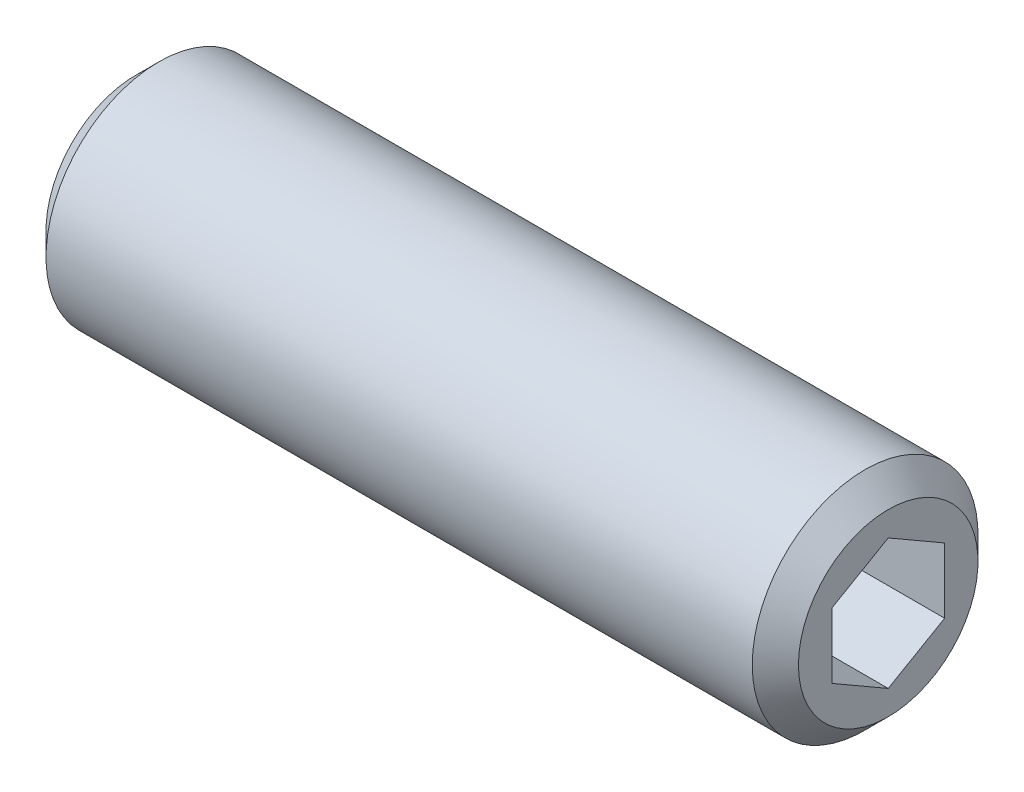
ISO-10303-21;
HEADER;
FILE_DESCRIPTION(('STEP AP214'),'2;1');
FILE_NAME('part.step','',(''),(''),'','','');
FILE_SCHEMA(('AUTOMOTIVE_DESIGN { 1 0 10303 214 1 1 1 1 }'));
ENDSEC;
DATA;
#1=APPLICATION_CONTEXT('core data for automotive mechanical design processes');
#2=APPLICATION_PROTOCOL_DEFINITION('international standard','automotive_design',2000,#1);
#3=PRODUCT_CONTEXT('',#1,'mechanical');
#4=PRODUCT('Part','Part','',(#3));
#5=PRODUCT_RELATED_PRODUCT_CATEGORY('part','',(#4));
#6=PRODUCT_DEFINITION_FORMATION('','',#4);
#7=PRODUCT_DEFINITION_CONTEXT('part definition',#1,'design');
#8=PRODUCT_DEFINITION('design','',#6,#7);
#9=PRODUCT_DEFINITION_SHAPE('','',#8);
#10=(LENGTH_UNIT() NAMED_UNIT(*) SI_UNIT(.MILLI.,.METRE.));
#11=(NAMED_UNIT(*) PLANE_ANGLE_UNIT() SI_UNIT($,.RADIAN.));
#12=(NAMED_UNIT(*) SI_UNIT($,.STERADIAN.) SOLID_ANGLE_UNIT());
#13=UNCERTAINTY_MEASURE_WITH_UNIT(LENGTH_MEASURE(1.E-05),#10,'distance_accuracy_value','');
#14=(GEOMETRIC_REPRESENTATION_CONTEXT(3) GLOBAL_UNCERTAINTY_ASSIGNED_CONTEXT((#13)) GLOBAL_UNIT_ASSIGNED_CONTEXT((#10,
#11,#12)) REPRESENTATION_CONTEXT('',''));
#15=CARTESIAN_POINT('',(0.,0.,0.));
#16=DIRECTION('',(0.,0.,1.));
#17=DIRECTION('',(1.,0.,0.));
#18=AXIS2_PLACEMENT_3D('',#15,#16,#17);
#19=CARTESIAN_POINT('',(10.,-0.433012701892202,-0.750000000000006));
#20=DIRECTION('',(0.,0.,-1.));
#21=DIRECTION('',(0.,1.,0.));
#22=AXIS2_PLACEMENT_3D('',#19,#20,#21);
#23=PLANE('',#22);
#24=DIRECTION('',(1.,0.,0.));
#25=VECTOR('',#24,1.);
#26=CARTESIAN_POINT('',(10.,-0.433012701892204,-0.750000000000003));
#27=LINE('',#26,#25);
#28=CARTESIAN_POINT('',(7.99999999998905,-0.433012701892995,-0.750000000001374));
#29=VERTEX_POINT('',#28);
#30=CARTESIAN_POINT('',(10.,-0.433012701892204,-0.750000000000004));
#31=VERTEX_POINT('',#30);
#32=EDGE_CURVE('E77',#29,#31,#27,.T.);
#33=ORIENTED_EDGE('',*,*,#32,.T.);
#34=DIRECTION('',(0.,1.,0.));
#35=VECTOR('',#34,1.);
#36=CARTESIAN_POINT('',(10.,-0.433012701892202,-0.750000000000006));
#37=LINE('',#36,#35);
#38=CARTESIAN_POINT('',(10.,0.433012701892233,-0.749999999999989));
#39=VERTEX_POINT('',#38);
#40=EDGE_CURVE('E83',#39,#31,#37,.F.);
#41=ORIENTED_EDGE('',*,*,#40,.F.);
#42=DIRECTION('',(1.,0.,0.));
#43=VECTOR('',#42,1.);
#44=CARTESIAN_POINT('',(10.,0.433012701892233,-0.749999999999989));
#45=LINE('',#44,#43);
#46=CARTESIAN_POINT('',(7.99999999998859,0.433012701893813,-0.749999999999989));
#47=VERTEX_POINT('',#46);
#48=EDGE_CURVE('E80',#39,#47,#45,.F.);
#49=ORIENTED_EDGE('',*,*,#48,.T.);
#50=CARTESIAN_POINT('',(7.99999999998905,-0.433012701895366,-0.750000000000006));
#51=CARTESIAN_POINT('',(7.98901082827057,-0.394956130487069,-0.750000000000005));
#52=CARTESIAN_POINT('',(7.97901675265749,-0.356571055071816,-0.750000000000004));
#53=CARTESIAN_POINT('',(7.9615723944878,-0.279136292184678,-0.750000000000003));
#54=CARTESIAN_POINT('',(7.95412828241216,-0.240085229294405,-0.750000000000002));
#55=CARTESIAN_POINT('',(7.94254098479773,-0.162467043916568,-0.750000000000001));
#56=CARTESIAN_POINT('',(7.93832067039372,-0.1239118606329,-0.75));
#57=CARTESIAN_POINT('',(7.93328343798614,-0.0466201738001358,-0.749999999999998));
#58=CARTESIAN_POINT('',(7.93246234771774,-0.00788395099258692,-0.749999999999997));
#59=CARTESIAN_POINT('',(7.93417485881037,0.0644905257924131,-0.749999999999996));
#60=CARTESIAN_POINT('',(7.9362879819497,0.0981396401509972,-0.749999999999995));
#61=CARTESIAN_POINT('',(7.94298398775631,0.165218655866387,-0.749999999999994));
#62=CARTESIAN_POINT('',(7.94756915552737,0.19864832538796,-0.749999999999993));
#63=CARTESIAN_POINT('',(7.95903118749256,0.265865530203378,-0.749999999999992));
#64=CARTESIAN_POINT('',(7.96595661582194,0.299644562544435,-0.749999999999991));
#65=CARTESIAN_POINT('',(7.98167441030362,0.366698958674413,-0.74999999999999));
#66=CARTESIAN_POINT('',(7.99046308577034,0.399975180844981,-0.749999999999989));
#67=CARTESIAN_POINT('',(7.99999999998905,0.433012701895392,-0.749999999999989));
#68=B_SPLINE_CURVE_WITH_KNOTS('',3,(#50,#51,#52,#53,#54,#55,#56,#57,#58,#59,#60,#61,#62,#63,#64,
#65,#66,#67),.UNSPECIFIED.,.F.,.F.,(4,2,2,2,2,2,2,2,4),(0.,0.118881004365211,0.238047681452815,
0.354265352374621,0.470340333403598,0.57139041855578,0.672534072743626,0.775920608505794,
0.87910424014248),.UNSPECIFIED.);
#69=EDGE_CURVE('E21',#29,#47,#68,.T.);
#70=ORIENTED_EDGE('',*,*,#69,.F.);
#71=EDGE_LOOP('',(#33,#41,#49,#70));
#72=FACE_BOUND('',#71,.T.);
#73=ADVANCED_FACE('F17',(#72),#23,.F.);
#74=CARTESIAN_POINT('',(10.,-0.866025403784435,0.));
#75=DIRECTION('',(0.,-0.866025403784429,-0.500000000000017));
#76=DIRECTION('',(0.,0.500000000000017,-0.866025403784429));
#77=AXIS2_PLACEMENT_3D('',#74,#75,#76);
#78=PLANE('',#77);
#79=DIRECTION('',(1.,0.,0.));
#80=VECTOR('',#79,1.);
#81=CARTESIAN_POINT('',(10.,-0.866025403784434,0.));
#82=LINE('',#81,#80);
#83=CARTESIAN_POINT('',(7.99999999998802,-0.866025403784234,-3.63860124789172E-13));
#84=VERTEX_POINT('',#83);
#85=CARTESIAN_POINT('',(10.,-0.866025403784434,0.));
#86=VERTEX_POINT('',#85);
#87=EDGE_CURVE('E154',#84,#86,#82,.T.);
#88=ORIENTED_EDGE('',*,*,#87,.T.);
#89=DIRECTION('',(0.,0.500000000000017,-0.866025403784429));
#90=VECTOR('',#89,1.);
#91=CARTESIAN_POINT('',(10.,-0.866025403784435,0.));
#92=LINE('',#91,#90);
#93=EDGE_CURVE('E93',#31,#86,#92,.F.);
#94=ORIENTED_EDGE('',*,*,#93,.F.);
#95=ORIENTED_EDGE('',*,*,#32,.F.);
#96=CARTESIAN_POINT('',(7.99999999998791,-0.866025403784034,-7.12328628866254E-13));
#97=CARTESIAN_POINT('',(7.98901082826951,-0.846997118079918,-0.0329579576211769));
#98=CARTESIAN_POINT('',(7.97901675265654,-0.827804580372323,-0.06620040805691));
#99=CARTESIAN_POINT('',(7.96157239448706,-0.789087198928822,-0.133260879853075));
#100=CARTESIAN_POINT('',(7.95412828241152,-0.769561667483722,-0.167080092360772));
#101=CARTESIAN_POINT('',(7.94254098479731,-0.730752574794874,-0.234299412693503));
#102=CARTESIAN_POINT('',(7.9383206703934,-0.711474983153075,-0.267689180864662));
#103=CARTESIAN_POINT('',(7.93328343798603,-0.672829139736769,-0.334625745163053));
#104=CARTESIAN_POINT('',(7.93246234771773,-0.653461028333034,-0.368172298160975));
#105=CARTESIAN_POINT('',(7.93417485881052,-0.617273789940701,-0.430850433642099));
#106=CARTESIAN_POINT('',(7.9362879819499,-0.600449232761536,-0.45999142149126));
#107=CARTESIAN_POINT('',(7.94298398775657,-0.566909724904095,-0.5180835531612));
#108=CARTESIAN_POINT('',(7.94756915552764,-0.550194890143436,-0.547034496206779));
#109=CARTESIAN_POINT('',(7.95903118749282,-0.516586287735986,-0.605246303147861));
#110=CARTESIAN_POINT('',(7.96595661582217,-0.499696771565589,-0.634499803270243));
#111=CARTESIAN_POINT('',(7.98167441030376,-0.46616957350086,-0.692570613753776));
#112=CARTESIAN_POINT('',(7.99046308577041,-0.449531462415704,-0.721388667495241));
#113=CARTESIAN_POINT('',(7.99999999998905,-0.433012701890623,-0.750000000002742));
#114=B_SPLINE_CURVE_WITH_KNOTS('',3,(#96,#97,#98,#99,#100,#101,#102,#103,#104,#105,#106,#107,
#108,#109,#110,#111,#112,#113),.UNSPECIFIED.,.F.,.F.,(4,2,2,2,2,2,2,2,4),(0.,0.118881004364944,
0.238047681452273,0.35426535237383,0.470340333402559,0.571390418553991,0.672534072741082,
0.775920608502456,0.879104240138354),.UNSPECIFIED.);
#115=EDGE_CURVE('E85',#84,#29,#114,.T.);
#116=ORIENTED_EDGE('',*,*,#115,.F.);
#117=EDGE_LOOP('',(#88,#94,#95,#116));
#118=FACE_BOUND('',#117,.T.);
#119=ADVANCED_FACE('F94',(#118),#78,.F.);
#120=CARTESIAN_POINT('',(10.,0.433012701892233,-0.749999999999989));
#121=DIRECTION('',(0.,0.866025403784449,-0.499999999999983));
#122=DIRECTION('',(0.,0.499999999999983,0.866025403784449));
#123=AXIS2_PLACEMENT_3D('',#120,#121,#122);
#124=PLANE('',#123);
#125=ORIENTED_EDGE('',*,*,#48,.F.);
#126=DIRECTION('',(0.,0.499999999999983,0.866025403784449));
#127=VECTOR('',#126,1.);
#128=CARTESIAN_POINT('',(10.,0.433012701892233,-0.749999999999989));
#129=LINE('',#128,#127);
#130=CARTESIAN_POINT('',(10.,0.866025403784439,0.));
#131=VERTEX_POINT('',#130);
#132=EDGE_CURVE('E92',#131,#39,#129,.F.);
#133=ORIENTED_EDGE('',*,*,#132,.F.);
#134=DIRECTION('',(1.,0.,0.));
#135=VECTOR('',#134,1.);
#136=CARTESIAN_POINT('',(10.,0.866025403784443,0.));
#137=LINE('',#136,#135);
#138=CARTESIAN_POINT('',(8.00000000479879,0.866025412116726,1.44319543748989E-08));
#139=VERTEX_POINT('',#138);
#140=EDGE_CURVE('E214',#131,#139,#137,.F.);
#141=ORIENTED_EDGE('',*,*,#140,.T.);
#142=CARTESIAN_POINT('',(7.99999999998905,0.433012701890651,-0.750000000002728));
#143=CARTESIAN_POINT('',(7.98901082826748,0.452040987600214,-0.717042042372828));
#144=CARTESIAN_POINT('',(7.97901675265184,0.471233525313321,-0.683799591927542));
#145=CARTESIAN_POINT('',(7.96157239447831,0.50995090676871,-0.61673912011078));
#146=CARTESIAN_POINT('',(7.9541282824015,0.529476438220196,-0.582919907592021));
#147=CARTESIAN_POINT('',(7.9425409847907,0.56828553091007,-0.515700587257507));
#148=CARTESIAN_POINT('',(7.93832067038958,0.587563122546362,-0.482310819095882));
#149=CARTESIAN_POINT('',(7.93328343798548,0.626208965950657,-0.41537425481829));
#150=CARTESIAN_POINT('',(7.93246234771757,0.645577077347884,-0.381827701831638));
#151=CARTESIAN_POINT('',(7.93417485887736,0.681764317141776,-0.319149563922936));
#152=CARTESIAN_POINT('',(7.93628798230418,0.698588875725989,-0.290008573640159));
#153=CARTESIAN_POINT('',(7.94298398908129,0.732128386370181,-0.231916437143418));
#154=CARTESIAN_POINT('',(7.9475691575363,0.748843222512488,-0.202965491704752));
#155=CARTESIAN_POINT('',(7.95903119120688,0.782451827715217,-0.1447536799221));
#156=CARTESIAN_POINT('',(7.96595662057005,0.799341345297872,-0.115500177353611));
#157=CARTESIAN_POINT('',(7.98167441734414,0.832868546135736,-0.0574293620668633));
#158=CARTESIAN_POINT('',(7.99046309406811,0.849506658581953,-0.0286113059679694));
#159=CARTESIAN_POINT('',(8.00000000960943,0.866025420449008,2.88639030046372E-08));
#160=B_SPLINE_CURVE_WITH_KNOTS('',3,(#142,#143,#144,#145,#146,#147,#148,#149,#150,#151,#152,
#153,#154,#155,#156,#157,#158,#159),.UNSPECIFIED.,.F.,.F.,(4,2,2,2,2,2,2,2,4),(0.,
0.11888100439893,0.238047681524581,0.354265352412084,0.470340333403614,0.571390426997281,
0.672534089657842,0.775920634332708,0.879104274814231),.UNSPECIFIED.);
#161=EDGE_CURVE('E149',#47,#139,#160,.T.);
#162=ORIENTED_EDGE('',*,*,#161,.F.);
#163=EDGE_LOOP('',(#125,#133,#141,#162));
#164=FACE_BOUND('',#163,.T.);
#165=ADVANCED_FACE('F155',(#164),#124,.F.);
#166=CARTESIAN_POINT('',(10.,-0.433012701892234,0.749999999999986));
#167=DIRECTION('',(0.,-0.866025403784449,0.499999999999983));
#168=DIRECTION('',(0.,-0.499999999999983,-0.866025403784449));
#169=AXIS2_PLACEMENT_3D('',#166,#167,#168);
#170=PLANE('',#169);
#171=DIRECTION('',(1.,0.,0.));
#172=VECTOR('',#171,1.);
#173=CARTESIAN_POINT('',(10.,-0.433012701892234,0.749999999999986));
#174=LINE('',#173,#172);
#175=CARTESIAN_POINT('',(7.99999999229925,-0.433012740202588,0.749999962503712));
#176=VERTEX_POINT('',#175);
#177=CARTESIAN_POINT('',(10.,-0.43301270189223,0.749999999999996));
#178=VERTEX_POINT('',#177);
#179=EDGE_CURVE('E207',#176,#178,#174,.T.);
#180=ORIENTED_EDGE('',*,*,#179,.T.);
#181=DIRECTION('',(0.,-0.499999999999983,-0.866025403784449));
#182=VECTOR('',#181,1.);
#183=CARTESIAN_POINT('',(10.,-0.433012701892234,0.749999999999986));
#184=LINE('',#183,#182);
#185=EDGE_CURVE('E220',#86,#178,#184,.F.);
#186=ORIENTED_EDGE('',*,*,#185,.F.);
#187=ORIENTED_EDGE('',*,*,#87,.F.);
#188=CARTESIAN_POINT('',(7.9999999999879,-0.866025403784033,6.80000783128613E-13));
#189=CARTESIAN_POINT('',(7.98901082827753,-0.846997118093987,0.0329579575967761));
#190=CARTESIAN_POINT('',(7.97901675267123,-0.827804580400638,0.0662004080078387));
#191=CARTESIAN_POINT('',(7.96157239451172,-0.789087198987857,0.133260879750802));
#192=CARTESIAN_POINT('',(7.95412828243922,-0.769561667559259,0.167080092229918));
#193=CARTESIAN_POINT('',(7.94254098481559,-0.7307525748729,0.234299412558344));
#194=CARTESIAN_POINT('',(7.93832067040416,-0.711474983216705,0.267689180754442));
#195=CARTESIAN_POINT('',(7.93328343798776,-0.672829139768996,0.33462574510723));
#196=CARTESIAN_POINT('',(7.93246234771818,-0.653461028348249,0.36817229813462));
#197=CARTESIAN_POINT('',(7.93417485863644,-0.61727379359742,0.43085042730848));
#198=CARTESIAN_POINT('',(7.93628798102879,-0.600449240068925,0.459991408834498));
#199=CARTESIAN_POINT('',(7.94298398431362,-0.566909739452162,0.518083527963221));
#200=CARTESIAN_POINT('',(7.94756915030746,-0.550194908281368,0.547034464790975));
#201=CARTESIAN_POINT('',(7.95903117784122,-0.516586313136742,0.605246259152482));
#202=CARTESIAN_POINT('',(7.96595660348428,-0.49969680063574,0.634499752919288));
#203=CARTESIAN_POINT('',(7.98167439200907,-0.466169609776291,0.692570550922915));
#204=CARTESIAN_POINT('',(7.99046306420877,-0.449531502227503,0.721388598539212));
#205=CARTESIAN_POINT('',(7.99999997499062,-0.433012745189202,0.749999925007439));
#206=B_SPLINE_CURVE_WITH_KNOTS('',3,(#188,#189,#190,#191,#192,#193,#194,#195,#196,#197,#198,
#199,#200,#201,#202,#203,#204,#205),.UNSPECIFIED.,.F.,.F.,(4,2,2,2,2,2,2,2,4),(0.,
0.118881004277328,0.238047681265788,0.354265352276481,0.470340333402514,0.571390396618868,
0.67253402878973,0.775920541391586,0.879104150044302),.UNSPECIFIED.);
#207=EDGE_CURVE('E88',#84,#176,#206,.T.);
#208=ORIENTED_EDGE('',*,*,#207,.T.);
#209=EDGE_LOOP('',(#180,#186,#187,#208));
#210=FACE_BOUND('',#209,.T.);
#211=ADVANCED_FACE('F158',(#210),#170,.F.);
#212=CARTESIAN_POINT('',(10.,0.866025403784436,0.));
#213=DIRECTION('',(0.,0.866025403784428,0.500000000000019));
#214=DIRECTION('',(0.,-0.500000000000019,0.866025403784428));
#215=AXIS2_PLACEMENT_3D('',#212,#213,#214);
#216=PLANE('',#215);
#217=ORIENTED_EDGE('',*,*,#140,.F.);
#218=DIRECTION('',(0.,-0.500000000000019,0.866025403784428));
#219=VECTOR('',#218,1.);
#220=CARTESIAN_POINT('',(10.,0.866025403784436,0.));
#221=LINE('',#220,#219);
#222=CARTESIAN_POINT('',(10.,0.433012701892201,0.750000000000006));
#223=VERTEX_POINT('',#222);
#224=EDGE_CURVE('E40',#223,#131,#221,.F.);
#225=ORIENTED_EDGE('',*,*,#224,.F.);
#226=DIRECTION('',(1.,0.,0.));
#227=VECTOR('',#226,1.);
#228=CARTESIAN_POINT('',(10.,0.433012701892201,0.750000000000006));
#229=LINE('',#228,#227);
#230=CARTESIAN_POINT('',(7.99999998748596,0.433012723546615,0.749999962493461));
#231=VERTEX_POINT('',#230);
#232=EDGE_CURVE('E121',#223,#231,#229,.F.);
#233=ORIENTED_EDGE('',*,*,#232,.T.);
#234=CARTESIAN_POINT('',(7.99999997498378,0.433012745201029,0.749999924986916));
#235=CARTESIAN_POINT('',(7.98901080531911,0.452041030174306,0.717041968632303));
#236=CARTESIAN_POINT('',(7.97901673188756,0.471233567146361,0.683799519470561));
#237=CARTESIAN_POINT('',(7.96157237824559,0.509950947046468,0.616739050347633));
#238=CARTESIAN_POINT('',(7.9541282685133,0.529476477683244,0.582919839239995));
#239=CARTESIAN_POINT('',(7.94254097553146,0.568285568787397,0.515700521652037));
#240=CARTESIAN_POINT('',(7.93832066343083,0.587563159656045,0.482310754820014));
#241=CARTESIAN_POINT('',(7.9332834354752,0.626209001436508,0.415374193354988));
#242=CARTESIAN_POINT('',(7.93246234735725,0.64557711197773,0.381827641850983));
#243=CARTESIAN_POINT('',(7.93417486184809,0.681764343050796,0.319149519047201));
#244=CARTESIAN_POINT('',(7.93628798540334,0.698588893795787,0.290008542342357));
#245=CARTESIAN_POINT('',(7.94298399008278,0.732128388836506,0.23191643287163));
#246=CARTESIAN_POINT('',(7.9475691563063,0.748843217214822,0.202965500880593));
#247=CARTESIAN_POINT('',(7.95903118344071,0.782451806675166,0.144753716364556));
#248=CARTESIAN_POINT('',(7.96595660842472,0.799341316286466,0.115500227602864));
#249=CARTESIAN_POINT('',(7.98167439494444,0.832868501455523,0.0574294394552908));
#250=CARTESIAN_POINT('',(7.99046306580088,0.84950660620332,0.0286113966904547));
#251=CARTESIAN_POINT('',(7.99999997498906,0.866025360484765,7.49972468473498E-08));
#252=B_SPLINE_CURVE_WITH_KNOTS('',3,(#234,#235,#236,#237,#238,#239,#240,#241,#242,#243,#244,
#245,#246,#247,#248,#249,#250,#251),.UNSPECIFIED.,.F.,.F.,(4,2,2,2,2,2,2,2,4),(0.,
0.118880998434469,0.238047669428919,0.354265334986666,0.470340310716303,0.571390357539904,
0.672533973254723,0.775920468508521,0.879104059924009),.UNSPECIFIED.);
#253=EDGE_CURVE('E145',#231,#139,#252,.T.);
#254=ORIENTED_EDGE('',*,*,#253,.T.);
#255=EDGE_LOOP('',(#217,#225,#233,#254));
#256=FACE_BOUND('',#255,.T.);
#257=ADVANCED_FACE('F133',(#256),#216,.F.);
#258=CARTESIAN_POINT('',(8.00300000003062,0.,0.));
#259=DIRECTION('',(1.,0.,0.));
#260=DIRECTION('',(0.,0.,-1.));
#261=AXIS2_PLACEMENT_3D('',#258,#259,#260);
#262=CONICAL_SURFACE('',#261,0.871221556280943,1.04719755121415);
#263=CARTESIAN_POINT('',(7.50000000005002,1.13686837721616E-10,0.));
#264=VERTEX_POINT('',#263);
#265=VERTEX_LOOP('',#264);
#266=FACE_BOUND('',#265,.T.);
#267=ORIENTED_EDGE('',*,*,#207,.F.);
#268=ORIENTED_EDGE('',*,*,#115,.T.);
#269=ORIENTED_EDGE('',*,*,#69,.T.);
#270=ORIENTED_EDGE('',*,*,#161,.T.);
#271=ORIENTED_EDGE('',*,*,#253,.F.);
#272=CARTESIAN_POINT('',(8.00000000960213,0.433012735196061,0.750000000000006));
#273=CARTESIAN_POINT('',(7.98901083709407,0.394956163225799,0.750000000000005));
#274=CARTESIAN_POINT('',(7.97901676064232,0.356571087244967,0.750000000000004));
#275=CARTESIAN_POINT('',(7.96157240073198,0.279136323171064,0.750000000000002));
#276=CARTESIAN_POINT('',(7.95412828775546,0.240085259659246,0.750000000000002));
#277=CARTESIAN_POINT('',(7.94254098836007,0.162467073062905,0.75));
#278=CARTESIAN_POINT('',(7.93832067307054,0.123911889184754,0.749999999999999));
#279=CARTESIAN_POINT('',(7.93328343895146,0.0466202010941767,0.749999999999997));
#280=CARTESIAN_POINT('',(7.93246234785633,0.0078839776234345,0.749999999999996));
#281=CARTESIAN_POINT('',(7.93417485764259,-0.0644905047916293,0.749999999999994));
#282=CARTESIAN_POINT('',(7.93628798062227,-0.0981396240997175,0.749999999999994));
#283=CARTESIAN_POINT('',(7.94298398686298,-0.165218649674384,0.749999999999992));
#284=CARTESIAN_POINT('',(7.94756915522953,-0.19864832410557,0.749999999999991));
#285=CARTESIAN_POINT('',(7.95903118905326,-0.265865538880532,0.74999999999999));
#286=CARTESIAN_POINT('',(7.96595661866958,-0.29964457626716,0.749999999999989));
#287=CARTESIAN_POINT('',(7.98167441621403,-0.366698982317099,0.749999999999988));
#288=CARTESIAN_POINT('',(7.99046309345414,-0.399975209362662,0.749999999999987));
#289=CARTESIAN_POINT('',(8.00000000960787,-0.433012735215973,0.749999999999986));
#290=B_SPLINE_CURVE_WITH_KNOTS('',3,(#272,#273,#274,#275,#276,#277,#278,#279,#280,#281,#282,
#283,#284,#285,#286,#287,#288,#289),.UNSPECIFIED.,.F.,.F.,(4,2,2,2,2,2,2,2,4),(0.,
0.118881006645267,0.238047686075366,0.354265359059314,0.470340342125551,0.571390442019677,
0.672534111005021,0.775920662347517,0.879104309454076),.UNSPECIFIED.);
#291=EDGE_CURVE('E115',#231,#176,#290,.T.);
#292=ORIENTED_EDGE('',*,*,#291,.T.);
#293=EDGE_LOOP('',(#267,#268,#269,#270,#271,#292));
#294=FACE_BOUND('',#293,.T.);
#295=ADVANCED_FACE('F86',(#266,#294),#262,.F.);
#296=CARTESIAN_POINT('',(10.,0.433012701892201,0.750000000000006));
#297=DIRECTION('',(0.,0.,1.));
#298=DIRECTION('',(0.,-1.,0.));
#299=AXIS2_PLACEMENT_3D('',#296,#297,#298);
#300=PLANE('',#299);
#301=ORIENTED_EDGE('',*,*,#232,.F.);
#302=DIRECTION('',(0.,-1.,0.));
#303=VECTOR('',#302,1.);
#304=CARTESIAN_POINT('',(10.,0.,0.750000000000006));
#305=LINE('',#304,#303);
#306=EDGE_CURVE('E114',#223,#178,#305,.T.);
#307=ORIENTED_EDGE('',*,*,#306,.T.);
#308=ORIENTED_EDGE('',*,*,#179,.F.);
#309=ORIENTED_EDGE('',*,*,#291,.F.);
#310=EDGE_LOOP('',(#301,#307,#308,#309));
#311=FACE_BOUND('',#310,.T.);
#312=ADVANCED_FACE('F127',(#311),#300,.F.);
#313=CARTESIAN_POINT('',(10.,0.,0.));
#314=DIRECTION('',(-1.,0.,0.));
#315=DIRECTION('',(0.,-1.,0.));
#316=AXIS2_PLACEMENT_3D('',#313,#314,#315);
#317=PLANE('',#316);
#318=ORIENTED_EDGE('',*,*,#224,.T.);
#319=ORIENTED_EDGE('',*,*,#132,.T.);
#320=ORIENTED_EDGE('',*,*,#40,.T.);
#321=ORIENTED_EDGE('',*,*,#93,.T.);
#322=ORIENTED_EDGE('',*,*,#185,.T.);
#323=ORIENTED_EDGE('',*,*,#306,.F.);
#324=EDGE_LOOP('',(#318,#319,#320,#321,#322,#323));
#325=FACE_BOUND('',#324,.T.);
#326=CARTESIAN_POINT('',(9.99999999993406,0.,0.));
#327=DIRECTION('',(-1.,0.,0.));
#328=DIRECTION('',(0.,0.,1.));
#329=AXIS2_PLACEMENT_3D('',#326,#327,#328);
#330=CIRCLE('',#329,1.19327499999144);
#331=CARTESIAN_POINT('',(9.99999999993406,0.,1.19327499999144));
#332=VERTEX_POINT('',#331);
#333=EDGE_CURVE('E111',#332,#332,#330,.T.);
#334=ORIENTED_EDGE('',*,*,#333,.F.);
#335=EDGE_LOOP('',(#334));
#336=FACE_BOUND('',#335,.T.);
#337=ADVANCED_FACE('F185',(#325,#336),#317,.F.);
#338=CARTESIAN_POINT('',(0.,0.75,0.));
#339=DIRECTION('',(-1.,0.,0.));
#340=DIRECTION('',(0.,-1.,0.));
#341=AXIS2_PLACEMENT_3D('',#338,#339,#340);
#342=PLANE('',#341);
#343=CARTESIAN_POINT('',(-5.6843418860808E-11,0.,0.));
#344=DIRECTION('',(1.,0.,0.));
#345=DIRECTION('',(0.,0.,-1.));
#346=AXIS2_PLACEMENT_3D('',#343,#344,#345);
#347=CIRCLE('',#346,1.19327499999144);
#348=CARTESIAN_POINT('',(-5.6843418860808E-11,0.,-1.19327499999144));
#349=VERTEX_POINT('',#348);
#350=EDGE_CURVE('E108',#349,#349,#347,.T.);
#351=ORIENTED_EDGE('',*,*,#350,.F.);
#352=EDGE_LOOP('',(#351));
#353=FACE_BOUND('',#352,.T.);
#354=ADVANCED_FACE('F182',(#353),#342,.T.);
#355=CARTESIAN_POINT('',(9.69327500001782,0.,0.));
#356=DIRECTION('',(-1.,0.,0.));
#357=DIRECTION('',(0.,0.,1.));
#358=AXIS2_PLACEMENT_3D('',#355,#356,#357);
#359=CONICAL_SURFACE('',#358,1.49999999996453,0.78539816349011);
#360=ORIENTED_EDGE('',*,*,#333,.T.);
#361=EDGE_LOOP('',(#360));
#362=FACE_BOUND('',#361,.T.);
#363=CARTESIAN_POINT('',(9.693275,0.,0.));
#364=DIRECTION('',(1.,0.,0.));
#365=DIRECTION('',(0.,1.,0.));
#366=AXIS2_PLACEMENT_3D('',#363,#364,#365);
#367=CIRCLE('',#366,1.5);
#368=CARTESIAN_POINT('',(9.693275,1.5,0.));
#369=VERTEX_POINT('',#368);
#370=EDGE_CURVE('E31',#369,#369,#367,.F.);
#371=ORIENTED_EDGE('',*,*,#370,.F.);
#372=EDGE_LOOP('',(#371));
#373=FACE_BOUND('',#372,.T.);
#374=ADVANCED_FACE('F175',(#362,#373),#359,.T.);
#375=CARTESIAN_POINT('',(0.306724999973085,0.,0.));
#376=DIRECTION('',(1.,0.,0.));
#377=DIRECTION('',(0.,0.,-1.));
#378=AXIS2_PLACEMENT_3D('',#375,#376,#377);
#379=CONICAL_SURFACE('',#378,1.50000000002137,0.785398163397448);
#380=CARTESIAN_POINT('',(0.306725,0.,0.));
#381=DIRECTION('',(1.,0.,0.));
#382=DIRECTION('',(0.,1.,0.));
#383=AXIS2_PLACEMENT_3D('',#380,#381,#382);
#384=CIRCLE('',#383,1.5);
#385=CARTESIAN_POINT('',(0.306725,1.5,0.));
#386=VERTEX_POINT('',#385);
#387=EDGE_CURVE('E11',#386,#386,#384,.T.);
#388=ORIENTED_EDGE('',*,*,#387,.F.);
#389=EDGE_LOOP('',(#388));
#390=FACE_BOUND('',#389,.T.);
#391=ORIENTED_EDGE('',*,*,#350,.T.);
#392=EDGE_LOOP('',(#391));
#393=FACE_BOUND('',#392,.T.);
#394=ADVANCED_FACE('F169',(#390,#393),#379,.T.);
#395=CARTESIAN_POINT('',(5.,0.,0.));
#396=DIRECTION('',(1.,0.,0.));
#397=DIRECTION('',(0.,1.,0.));
#398=AXIS2_PLACEMENT_3D('',#395,#396,#397);
#399=CYLINDRICAL_SURFACE('',#398,1.5);
#400=ORIENTED_EDGE('',*,*,#387,.T.);
#401=EDGE_LOOP('',(#400));
#402=FACE_BOUND('',#401,.T.);
#403=ORIENTED_EDGE('',*,*,#370,.T.);
#404=EDGE_LOOP('',(#403));
#405=FACE_BOUND('',#404,.T.);
#406=ADVANCED_FACE('F167',(#402,#405),#399,.T.);
#407=CLOSED_SHELL('',(#73,#119,#165,#211,#257,#295,#312,#337,#354,#374,#394,#406));
#408=MANIFOLD_SOLID_BREP('B1',#407);
#409=ADVANCED_BREP_SHAPE_REPRESENTATION('',(#18,#408),#14);
#410=SHAPE_DEFINITION_REPRESENTATION(#9,#409);
ENDSEC;
END-ISO-10303-21;
